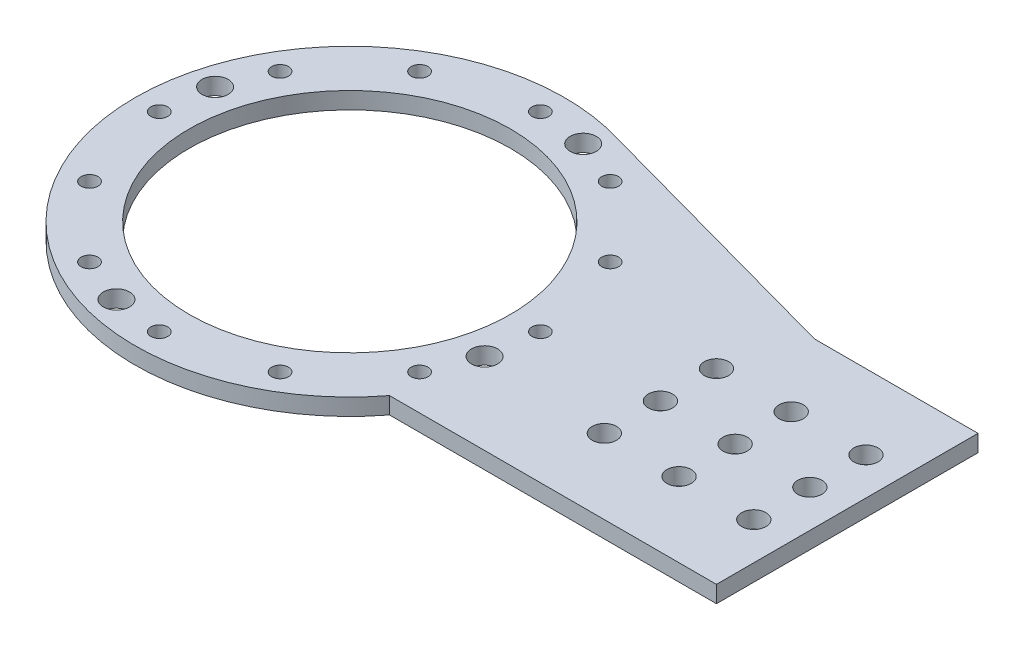
ISO-10303-21;
HEADER;
FILE_DESCRIPTION(('STEP AP214'),'2;1');
FILE_NAME('part.step','',(''),(''),'','','');
FILE_SCHEMA(('AUTOMOTIVE_DESIGN { 1 0 10303 214 1 1 1 1 }'));
ENDSEC;
DATA;
#1=APPLICATION_CONTEXT('core data for automotive mechanical design processes');
#2=APPLICATION_PROTOCOL_DEFINITION('international standard','automotive_design',2000,#1);
#3=PRODUCT_CONTEXT('',#1,'mechanical');
#4=PRODUCT('Part','Part','',(#3));
#5=PRODUCT_RELATED_PRODUCT_CATEGORY('part','',(#4));
#6=PRODUCT_DEFINITION_FORMATION('','',#4);
#7=PRODUCT_DEFINITION_CONTEXT('part definition',#1,'design');
#8=PRODUCT_DEFINITION('design','',#6,#7);
#9=PRODUCT_DEFINITION_SHAPE('','',#8);
#10=(LENGTH_UNIT() NAMED_UNIT(*) SI_UNIT(.MILLI.,.METRE.));
#11=(NAMED_UNIT(*) PLANE_ANGLE_UNIT() SI_UNIT($,.RADIAN.));
#12=(NAMED_UNIT(*) SI_UNIT($,.STERADIAN.) SOLID_ANGLE_UNIT());
#13=UNCERTAINTY_MEASURE_WITH_UNIT(LENGTH_MEASURE(1.E-05),#10,'distance_accuracy_value','');
#14=(GEOMETRIC_REPRESENTATION_CONTEXT(3) GLOBAL_UNCERTAINTY_ASSIGNED_CONTEXT((#13)) GLOBAL_UNIT_ASSIGNED_CONTEXT((#10,
#11,#12)) REPRESENTATION_CONTEXT('',''));
#15=CARTESIAN_POINT('',(0.,0.,0.));
#16=DIRECTION('',(0.,0.,1.));
#17=DIRECTION('',(1.,0.,0.));
#18=AXIS2_PLACEMENT_3D('',#15,#16,#17);
#19=CARTESIAN_POINT('',(83.1257980985413,-5.5,0.));
#20=DIRECTION('',(0.,1.,0.));
#21=DIRECTION('',(0.,0.,1.));
#22=AXIS2_PLACEMENT_3D('',#19,#20,#21);
#23=CYLINDRICAL_SURFACE('',#22,3.25000000000002);
#24=CARTESIAN_POINT('',(83.1257980985413,4.5,0.));
#25=DIRECTION('',(0.,1.,0.));
#26=DIRECTION('',(0.,0.,1.));
#27=AXIS2_PLACEMENT_3D('',#24,#25,#26);
#28=CIRCLE('',#27,3.25000000000002);
#29=CARTESIAN_POINT('',(83.1257980985413,4.5,3.25000000000002));
#30=VERTEX_POINT('',#29);
#31=EDGE_CURVE('E40',#30,#30,#28,.T.);
#32=ORIENTED_EDGE('',*,*,#31,.T.);
#33=EDGE_LOOP('',(#32));
#34=FACE_BOUND('',#33,.T.);
#35=CARTESIAN_POINT('',(83.1257980985413,0.,0.));
#36=DIRECTION('',(0.,1.,0.));
#37=DIRECTION('',(0.,0.,1.));
#38=AXIS2_PLACEMENT_3D('',#35,#36,#37);
#39=CIRCLE('',#38,3.25000000000002);
#40=CARTESIAN_POINT('',(83.1257980985413,0.,3.25000000000002));
#41=VERTEX_POINT('',#40);
#42=EDGE_CURVE('E11',#41,#41,#39,.T.);
#43=ORIENTED_EDGE('',*,*,#42,.F.);
#44=EDGE_LOOP('',(#43));
#45=FACE_BOUND('',#44,.T.);
#46=ADVANCED_FACE('F33',(#34,#45),#23,.F.);
#47=CARTESIAN_POINT('',(83.1257980985413,0.,15.));
#48=DIRECTION('',(0.,1.,0.));
#49=DIRECTION('',(0.,0.,1.));
#50=AXIS2_PLACEMENT_3D('',#47,#48,#49);
#51=CYLINDRICAL_SURFACE('',#50,3.25000000000001);
#52=CARTESIAN_POINT('',(83.1257980985413,0.,15.));
#53=DIRECTION('',(0.,1.,0.));
#54=DIRECTION('',(0.,0.,1.));
#55=AXIS2_PLACEMENT_3D('',#52,#53,#54);
#56=CIRCLE('',#55,3.25000000000001);
#57=CARTESIAN_POINT('',(83.1257980985413,0.,18.25));
#58=VERTEX_POINT('',#57);
#59=EDGE_CURVE('E120',#58,#58,#56,.T.);
#60=ORIENTED_EDGE('',*,*,#59,.F.);
#61=EDGE_LOOP('',(#60));
#62=FACE_BOUND('',#61,.T.);
#63=CARTESIAN_POINT('',(83.1257980985413,4.5,15.));
#64=DIRECTION('',(0.,1.,0.));
#65=DIRECTION('',(0.,0.,1.));
#66=AXIS2_PLACEMENT_3D('',#63,#64,#65);
#67=CIRCLE('',#66,3.25000000000001);
#68=CARTESIAN_POINT('',(83.1257980985413,4.5,18.25));
#69=VERTEX_POINT('',#68);
#70=EDGE_CURVE('E123',#69,#69,#67,.T.);
#71=ORIENTED_EDGE('',*,*,#70,.T.);
#72=EDGE_LOOP('',(#71));
#73=FACE_BOUND('',#72,.T.);
#74=ADVANCED_FACE('F191',(#62,#73),#51,.F.);
#75=CARTESIAN_POINT('',(83.1257980985413,0.,-15.));
#76=DIRECTION('',(0.,1.,0.));
#77=DIRECTION('',(0.,0.,1.));
#78=AXIS2_PLACEMENT_3D('',#75,#76,#77);
#79=CYLINDRICAL_SURFACE('',#78,3.25000000000001);
#80=CARTESIAN_POINT('',(83.1257980985413,0.,-15.));
#81=DIRECTION('',(0.,1.,0.));
#82=DIRECTION('',(0.,0.,1.));
#83=AXIS2_PLACEMENT_3D('',#80,#81,#82);
#84=CIRCLE('',#83,3.25000000000001);
#85=CARTESIAN_POINT('',(83.1257980985413,0.,-11.75));
#86=VERTEX_POINT('',#85);
#87=EDGE_CURVE('E113',#86,#86,#84,.T.);
#88=ORIENTED_EDGE('',*,*,#87,.F.);
#89=EDGE_LOOP('',(#88));
#90=FACE_BOUND('',#89,.T.);
#91=CARTESIAN_POINT('',(83.1257980985413,4.5,-15.));
#92=DIRECTION('',(0.,1.,0.));
#93=DIRECTION('',(0.,0.,1.));
#94=AXIS2_PLACEMENT_3D('',#91,#92,#93);
#95=CIRCLE('',#94,3.25000000000001);
#96=CARTESIAN_POINT('',(83.1257980985413,4.5,-11.75));
#97=VERTEX_POINT('',#96);
#98=EDGE_CURVE('E117',#97,#97,#95,.T.);
#99=ORIENTED_EDGE('',*,*,#98,.T.);
#100=EDGE_LOOP('',(#99));
#101=FACE_BOUND('',#100,.T.);
#102=ADVANCED_FACE('F195',(#90,#101),#79,.F.);
#103=CARTESIAN_POINT('',(0.,4.5,0.));
#104=DIRECTION('',(0.,-1.,0.));
#105=DIRECTION('',(0.,0.,-1.));
#106=AXIS2_PLACEMENT_3D('',#103,#104,#105);
#107=CYLINDRICAL_SURFACE('',#106,57.5);
#108=DIRECTION('',(0.,-1.,0.));
#109=VECTOR('',#108,1.);
#110=CARTESIAN_POINT('',(45.6207189772367,4.5,35.));
#111=LINE('',#110,#109);
#112=CARTESIAN_POINT('',(45.6207189772367,4.5,35.));
#113=VERTEX_POINT('',#112);
#114=CARTESIAN_POINT('',(45.6207189772367,0.,35.));
#115=VERTEX_POINT('',#114);
#116=EDGE_CURVE('E103',#113,#115,#111,.T.);
#117=ORIENTED_EDGE('',*,*,#116,.F.);
#118=CARTESIAN_POINT('',(0.,4.5,0.));
#119=DIRECTION('',(0.,1.,0.));
#120=DIRECTION('',(0.,0.,1.));
#121=AXIS2_PLACEMENT_3D('',#118,#119,#120);
#122=CIRCLE('',#121,57.5);
#123=CARTESIAN_POINT('',(16.7622892234834,4.5,-55.002505942805));
#124=VERTEX_POINT('',#123);
#125=EDGE_CURVE('E47',#124,#113,#122,.T.);
#126=ORIENTED_EDGE('',*,*,#125,.F.);
#127=DIRECTION('',(0.,-1.,0.));
#128=VECTOR('',#127,1.);
#129=CARTESIAN_POINT('',(16.7622892234842,4.5,-55.0025059428047));
#130=LINE('',#129,#128);
#131=CARTESIAN_POINT('',(16.7622892234834,0.,-55.002505942805));
#132=VERTEX_POINT('',#131);
#133=EDGE_CURVE('E51',#132,#124,#130,.F.);
#134=ORIENTED_EDGE('',*,*,#133,.F.);
#135=CARTESIAN_POINT('',(0.,0.,0.));
#136=DIRECTION('',(0.,1.,0.));
#137=DIRECTION('',(0.,0.,1.));
#138=AXIS2_PLACEMENT_3D('',#135,#136,#137);
#139=CIRCLE('',#138,57.5);
#140=EDGE_CURVE('E107',#132,#115,#139,.T.);
#141=ORIENTED_EDGE('',*,*,#140,.T.);
#142=EDGE_LOOP('',(#117,#126,#134,#141));
#143=FACE_BOUND('',#142,.T.);
#144=ADVANCED_FACE('F185',(#143),#107,.T.);
#145=CARTESIAN_POINT('',(133.125798098541,4.5,-35.));
#146=DIRECTION('',(0.,0.,1.));
#147=DIRECTION('',(1.,0.,0.));
#148=AXIS2_PLACEMENT_3D('',#145,#146,#147);
#149=PLANE('',#148);
#150=DIRECTION('',(0.,-1.,0.));
#151=VECTOR('',#150,1.);
#152=CARTESIAN_POINT('',(89.373258537889,4.5,-35.));
#153=LINE('',#152,#151);
#154=CARTESIAN_POINT('',(89.373258537889,4.5,-35.));
#155=VERTEX_POINT('',#154);
#156=CARTESIAN_POINT('',(89.373258537889,0.,-35.));
#157=VERTEX_POINT('',#156);
#158=EDGE_CURVE('E84',#155,#157,#153,.T.);
#159=ORIENTED_EDGE('',*,*,#158,.F.);
#160=DIRECTION('',(-1.,0.,0.));
#161=VECTOR('',#160,1.);
#162=CARTESIAN_POINT('',(133.125798098541,4.5,-35.));
#163=LINE('',#162,#161);
#164=CARTESIAN_POINT('',(133.125798098541,4.5,-35.));
#165=VERTEX_POINT('',#164);
#166=EDGE_CURVE('E77',#165,#155,#163,.T.);
#167=ORIENTED_EDGE('',*,*,#166,.F.);
#168=DIRECTION('',(0.,-1.,0.));
#169=VECTOR('',#168,1.);
#170=CARTESIAN_POINT('',(133.125798098541,4.5,-35.));
#171=LINE('',#170,#169);
#172=CARTESIAN_POINT('',(133.125798098541,0.,-35.));
#173=VERTEX_POINT('',#172);
#174=EDGE_CURVE('E81',#165,#173,#171,.T.);
#175=ORIENTED_EDGE('',*,*,#174,.T.);
#176=DIRECTION('',(-1.,0.,0.));
#177=VECTOR('',#176,1.);
#178=CARTESIAN_POINT('',(133.125798098541,0.,-35.));
#179=LINE('',#178,#177);
#180=EDGE_CURVE('E213',#173,#157,#179,.T.);
#181=ORIENTED_EDGE('',*,*,#180,.T.);
#182=EDGE_LOOP('',(#159,#167,#175,#181));
#183=FACE_BOUND('',#182,.T.);
#184=ADVANCED_FACE('F79',(#183),#149,.F.);
#185=CARTESIAN_POINT('',(0.,4.5,0.));
#186=DIRECTION('',(0.,1.,0.));
#187=DIRECTION('',(0.,0.,1.));
#188=AXIS2_PLACEMENT_3D('',#185,#186,#187);
#189=PLANE('',#188);
#190=CARTESIAN_POINT('',(103.125798098541,4.5,0.));
#191=DIRECTION('',(0.,1.,0.));
#192=DIRECTION('',(0.,0.,1.));
#193=AXIS2_PLACEMENT_3D('',#190,#191,#192);
#194=CIRCLE('',#193,3.25000000000002);
#195=CARTESIAN_POINT('',(103.125798098541,4.5,3.25000000000002));
#196=VERTEX_POINT('',#195);
#197=EDGE_CURVE('E318',#196,#196,#194,.T.);
#198=ORIENTED_EDGE('',*,*,#197,.F.);
#199=EDGE_LOOP('',(#198));
#200=FACE_BOUND('',#199,.T.);
#201=CARTESIAN_POINT('',(123.125798098541,4.5,0.));
#202=DIRECTION('',(0.,1.,0.));
#203=DIRECTION('',(0.,0.,1.));
#204=AXIS2_PLACEMENT_3D('',#201,#202,#203);
#205=CIRCLE('',#204,3.25000000000002);
#206=CARTESIAN_POINT('',(123.125798098541,4.5,3.25000000000002));
#207=VERTEX_POINT('',#206);
#208=EDGE_CURVE('E168',#207,#207,#205,.T.);
#209=ORIENTED_EDGE('',*,*,#208,.F.);
#210=EDGE_LOOP('',(#209));
#211=FACE_BOUND('',#210,.T.);
#212=CARTESIAN_POINT('',(-13.1997713002284,4.5,49.2622171407425));
#213=DIRECTION('',(0.,1.,0.));
#214=DIRECTION('',(1.,0.,0.));
#215=AXIS2_PLACEMENT_3D('',#212,#213,#214);
#216=CIRCLE('',#215,3.5);
#217=CARTESIAN_POINT('',(-9.69977130022841,4.5,49.2622171407425));
#218=VERTEX_POINT('',#217);
#219=EDGE_CURVE('E308',#218,#218,#216,.T.);
#220=ORIENTED_EDGE('',*,*,#219,.F.);
#221=EDGE_LOOP('',(#220));
#222=FACE_BOUND('',#221,.T.);
#223=CARTESIAN_POINT('',(49.2622171407425,4.5,13.1997713002286));
#224=DIRECTION('',(0.,1.,0.));
#225=DIRECTION('',(0.,0.,-1.));
#226=AXIS2_PLACEMENT_3D('',#223,#224,#225);
#227=CIRCLE('',#226,3.5);
#228=CARTESIAN_POINT('',(49.2622171407425,4.5,9.69977130022858));
#229=VERTEX_POINT('',#228);
#230=EDGE_CURVE('E302',#229,#229,#227,.T.);
#231=ORIENTED_EDGE('',*,*,#230,.F.);
#232=EDGE_LOOP('',(#231));
#233=FACE_BOUND('',#232,.T.);
#234=CARTESIAN_POINT('',(13.1997713002281,4.5,-49.2622171407426));
#235=DIRECTION('',(0.,1.,0.));
#236=DIRECTION('',(-1.,0.,0.));
#237=AXIS2_PLACEMENT_3D('',#234,#235,#236);
#238=CIRCLE('',#237,3.5);
#239=CARTESIAN_POINT('',(9.69977130022807,4.5,-49.2622171407426));
#240=VERTEX_POINT('',#239);
#241=EDGE_CURVE('E167',#240,#240,#238,.T.);
#242=ORIENTED_EDGE('',*,*,#241,.F.);
#243=EDGE_LOOP('',(#242));
#244=FACE_BOUND('',#243,.T.);
#245=CARTESIAN_POINT('',(-49.2622171407425,4.5,-13.1997713002286));
#246=DIRECTION('',(0.,1.,0.));
#247=DIRECTION('',(0.,0.,1.));
#248=AXIS2_PLACEMENT_3D('',#245,#246,#247);
#249=CIRCLE('',#248,3.5);
#250=CARTESIAN_POINT('',(-49.2622171407425,4.5,-9.69977130022858));
#251=VERTEX_POINT('',#250);
#252=EDGE_CURVE('E291',#251,#251,#249,.T.);
#253=ORIENTED_EDGE('',*,*,#252,.F.);
#254=EDGE_LOOP('',(#253));
#255=FACE_BOUND('',#254,.T.);
#256=CARTESIAN_POINT('',(-25.4999999999999,4.5,44.1672955930064));
#257=DIRECTION('',(0.,1.,0.));
#258=DIRECTION('',(0.86602540378444,0.,0.499999999999998));
#259=AXIS2_PLACEMENT_3D('',#256,#257,#258);
#260=CIRCLE('',#259,2.25);
#261=CARTESIAN_POINT('',(-23.5514428414849,4.5,45.2922955930064));
#262=VERTEX_POINT('',#261);
#263=EDGE_CURVE('E260',#262,#262,#260,.T.);
#264=ORIENTED_EDGE('',*,*,#263,.F.);
#265=EDGE_LOOP('',(#264));
#266=FACE_BOUND('',#265,.T.);
#267=CARTESIAN_POINT('',(1.78065548281E-13,4.5,51.));
#268=DIRECTION('',(0.,1.,0.));
#269=DIRECTION('',(1.,0.,0.));
#270=AXIS2_PLACEMENT_3D('',#267,#268,#269);
#271=CIRCLE('',#270,2.25);
#272=CARTESIAN_POINT('',(2.25000000000017,4.5,51.));
#273=VERTEX_POINT('',#272);
#274=EDGE_CURVE('E280',#273,#273,#271,.T.);
#275=ORIENTED_EDGE('',*,*,#274,.F.);
#276=EDGE_LOOP('',(#275));
#277=FACE_BOUND('',#276,.T.);
#278=CARTESIAN_POINT('',(25.5000000000002,4.5,44.1672955930063));
#279=DIRECTION('',(0.,1.,0.));
#280=DIRECTION('',(0.866025403784436,0.,-0.500000000000004));
#281=AXIS2_PLACEMENT_3D('',#278,#279,#280);
#282=CIRCLE('',#281,2.25);
#283=CARTESIAN_POINT('',(27.4485571585152,4.5,43.0422955930063));
#284=VERTEX_POINT('',#283);
#285=EDGE_CURVE('E277',#284,#284,#282,.T.);
#286=ORIENTED_EDGE('',*,*,#285,.F.);
#287=EDGE_LOOP('',(#286));
#288=FACE_BOUND('',#287,.T.);
#289=CARTESIAN_POINT('',(44.1672955930065,4.5,25.4999999999997));
#290=DIRECTION('',(0.,1.,0.));
#291=DIRECTION('',(0.499999999999995,0.,-0.866025403784442));
#292=AXIS2_PLACEMENT_3D('',#289,#290,#291);
#293=CIRCLE('',#292,2.25);
#294=CARTESIAN_POINT('',(45.2922955930065,4.5,23.5514428414848));
#295=VERTEX_POINT('',#294);
#296=EDGE_CURVE('E274',#295,#295,#293,.T.);
#297=ORIENTED_EDGE('',*,*,#296,.F.);
#298=EDGE_LOOP('',(#297));
#299=FACE_BOUND('',#298,.T.);
#300=CARTESIAN_POINT('',(51.,4.5,0.));
#301=DIRECTION('',(0.,1.,0.));
#302=DIRECTION('',(0.,0.,-1.));
#303=AXIS2_PLACEMENT_3D('',#300,#301,#302);
#304=CIRCLE('',#303,2.25);
#305=CARTESIAN_POINT('',(51.,4.5,-2.25));
#306=VERTEX_POINT('',#305);
#307=EDGE_CURVE('E271',#306,#306,#304,.T.);
#308=ORIENTED_EDGE('',*,*,#307,.F.);
#309=EDGE_LOOP('',(#308));
#310=FACE_BOUND('',#309,.T.);
#311=CARTESIAN_POINT('',(44.1672955930062,4.5,-25.5000000000004));
#312=DIRECTION('',(0.,1.,0.));
#313=DIRECTION('',(-0.500000000000007,0.,-0.866025403784435));
#314=AXIS2_PLACEMENT_3D('',#311,#312,#313);
#315=CIRCLE('',#314,2.25);
#316=CARTESIAN_POINT('',(43.0422955930061,4.5,-27.4485571585153));
#317=VERTEX_POINT('',#316);
#318=EDGE_CURVE('E268',#317,#317,#315,.T.);
#319=ORIENTED_EDGE('',*,*,#318,.F.);
#320=EDGE_LOOP('',(#319));
#321=FACE_BOUND('',#320,.T.);
#322=CARTESIAN_POINT('',(25.4999999999996,4.5,-44.1672955930066));
#323=DIRECTION('',(0.,1.,0.));
#324=DIRECTION('',(-0.866025403784443,0.,-0.499999999999992));
#325=AXIS2_PLACEMENT_3D('',#322,#323,#324);
#326=CIRCLE('',#325,2.25);
#327=CARTESIAN_POINT('',(23.5514428414846,4.5,-45.2922955930066));
#328=VERTEX_POINT('',#327);
#329=EDGE_CURVE('E264',#328,#328,#326,.T.);
#330=ORIENTED_EDGE('',*,*,#329,.F.);
#331=EDGE_LOOP('',(#330));
#332=FACE_BOUND('',#331,.T.);
#333=CARTESIAN_POINT('',(-5.34196644842999E-13,4.5,-51.));
#334=DIRECTION('',(0.,1.,0.));
#335=DIRECTION('',(-1.,0.,0.));
#336=AXIS2_PLACEMENT_3D('',#333,#334,#335);
#337=CIRCLE('',#336,2.25);
#338=CARTESIAN_POINT('',(-2.25000000000053,4.5,-51.));
#339=VERTEX_POINT('',#338);
#340=EDGE_CURVE('E261',#339,#339,#337,.T.);
#341=ORIENTED_EDGE('',*,*,#340,.F.);
#342=EDGE_LOOP('',(#341));
#343=FACE_BOUND('',#342,.T.);
#344=CARTESIAN_POINT('',(-25.5000000000005,4.5,-44.1672955930061));
#345=DIRECTION('',(0.,1.,0.));
#346=DIRECTION('',(-0.866025403784433,0.,0.50000000000001));
#347=AXIS2_PLACEMENT_3D('',#344,#345,#346);
#348=CIRCLE('',#347,2.25);
#349=CARTESIAN_POINT('',(-27.4485571585155,4.5,-43.042295593006));
#350=VERTEX_POINT('',#349);
#351=EDGE_CURVE('E265',#350,#350,#348,.T.);
#352=ORIENTED_EDGE('',*,*,#351,.F.);
#353=EDGE_LOOP('',(#352));
#354=FACE_BOUND('',#353,.T.);
#355=CARTESIAN_POINT('',(-44.1672955930067,4.5,-25.4999999999994));
#356=DIRECTION('',(0.,1.,0.));
#357=DIRECTION('',(-0.499999999999989,0.,0.866025403784445));
#358=AXIS2_PLACEMENT_3D('',#355,#356,#357);
#359=CIRCLE('',#358,2.25);
#360=CARTESIAN_POINT('',(-45.2922955930067,4.5,-23.5514428414844));
#361=VERTEX_POINT('',#360);
#362=EDGE_CURVE('E285',#361,#361,#359,.T.);
#363=ORIENTED_EDGE('',*,*,#362,.F.);
#364=EDGE_LOOP('',(#363));
#365=FACE_BOUND('',#364,.T.);
#366=CARTESIAN_POINT('',(-44.1672955930063,4.5,25.5));
#367=DIRECTION('',(0.,1.,0.));
#368=DIRECTION('',(0.500000000000001,0.,0.866025403784438));
#369=AXIS2_PLACEMENT_3D('',#366,#367,#368);
#370=CIRCLE('',#369,2.25);
#371=CARTESIAN_POINT('',(-43.0422955930063,4.5,27.448557158515));
#372=VERTEX_POINT('',#371);
#373=EDGE_CURVE('E135',#372,#372,#370,.T.);
#374=ORIENTED_EDGE('',*,*,#373,.F.);
#375=EDGE_LOOP('',(#374));
#376=FACE_BOUND('',#375,.T.);
#377=CARTESIAN_POINT('',(-51.,4.5,0.));
#378=DIRECTION('',(0.,1.,0.));
#379=DIRECTION('',(0.,0.,1.));
#380=AXIS2_PLACEMENT_3D('',#377,#378,#379);
#381=CIRCLE('',#380,2.25);
#382=CARTESIAN_POINT('',(-51.,4.5,2.25));
#383=VERTEX_POINT('',#382);
#384=EDGE_CURVE('E130',#383,#383,#381,.T.);
#385=ORIENTED_EDGE('',*,*,#384,.F.);
#386=EDGE_LOOP('',(#385));
#387=FACE_BOUND('',#386,.T.);
#388=CARTESIAN_POINT('',(103.125798098541,4.5,15.));
#389=DIRECTION('',(0.,1.,0.));
#390=DIRECTION('',(0.,0.,1.));
#391=AXIS2_PLACEMENT_3D('',#388,#389,#390);
#392=CIRCLE('',#391,3.25000000000001);
#393=CARTESIAN_POINT('',(103.125798098541,4.5,18.25));
#394=VERTEX_POINT('',#393);
#395=EDGE_CURVE('E251',#394,#394,#392,.T.);
#396=ORIENTED_EDGE('',*,*,#395,.F.);
#397=EDGE_LOOP('',(#396));
#398=FACE_BOUND('',#397,.T.);
#399=CARTESIAN_POINT('',(103.125798098541,4.5,-15.));
#400=DIRECTION('',(0.,1.,0.));
#401=DIRECTION('',(0.,0.,1.));
#402=AXIS2_PLACEMENT_3D('',#399,#400,#401);
#403=CIRCLE('',#402,3.25000000000001);
#404=CARTESIAN_POINT('',(103.125798098541,4.5,-11.75));
#405=VERTEX_POINT('',#404);
#406=EDGE_CURVE('E238',#405,#405,#403,.T.);
#407=ORIENTED_EDGE('',*,*,#406,.F.);
#408=EDGE_LOOP('',(#407));
#409=FACE_BOUND('',#408,.T.);
#410=CARTESIAN_POINT('',(123.125798098541,4.5,-15.));
#411=DIRECTION('',(0.,1.,0.));
#412=DIRECTION('',(0.,0.,1.));
#413=AXIS2_PLACEMENT_3D('',#410,#411,#412);
#414=CIRCLE('',#413,3.25000000000001);
#415=CARTESIAN_POINT('',(123.125798098541,4.5,-11.75));
#416=VERTEX_POINT('',#415);
#417=EDGE_CURVE('E241',#416,#416,#414,.T.);
#418=ORIENTED_EDGE('',*,*,#417,.F.);
#419=EDGE_LOOP('',(#418));
#420=FACE_BOUND('',#419,.T.);
#421=CARTESIAN_POINT('',(123.125798098541,4.5,15.));
#422=DIRECTION('',(0.,1.,0.));
#423=DIRECTION('',(0.,0.,1.));
#424=AXIS2_PLACEMENT_3D('',#421,#422,#423);
#425=CIRCLE('',#424,3.25000000000001);
#426=CARTESIAN_POINT('',(123.125798098541,4.5,18.25));
#427=VERTEX_POINT('',#426);
#428=EDGE_CURVE('E234',#427,#427,#425,.T.);
#429=ORIENTED_EDGE('',*,*,#428,.F.);
#430=EDGE_LOOP('',(#429));
#431=FACE_BOUND('',#430,.T.);
#432=CARTESIAN_POINT('',(0.,4.5,0.));
#433=DIRECTION('',(0.,1.,0.));
#434=DIRECTION('',(0.,0.,1.));
#435=AXIS2_PLACEMENT_3D('',#432,#433,#434);
#436=CIRCLE('',#435,43.);
#437=CARTESIAN_POINT('',(0.,4.5,43.));
#438=VERTEX_POINT('',#437);
#439=EDGE_CURVE('E228',#438,#438,#436,.T.);
#440=ORIENTED_EDGE('',*,*,#439,.F.);
#441=EDGE_LOOP('',(#440));
#442=FACE_BOUND('',#441,.T.);
#443=DIRECTION('',(-0.964088221769249,0.,-0.265582191883806));
#444=VECTOR('',#443,1.);
#445=CARTESIAN_POINT('',(89.373258537889,4.5,-35.));
#446=LINE('',#445,#444);
#447=EDGE_CURVE('E220',#155,#124,#446,.T.);
#448=ORIENTED_EDGE('',*,*,#447,.T.);
#449=ORIENTED_EDGE('',*,*,#125,.T.);
#450=DIRECTION('',(1.,0.,0.));
#451=VECTOR('',#450,1.);
#452=CARTESIAN_POINT('',(133.125798098541,4.5,35.));
#453=LINE('',#452,#451);
#454=CARTESIAN_POINT('',(133.125798098541,4.5,35.));
#455=VERTEX_POINT('',#454);
#456=EDGE_CURVE('E88',#113,#455,#453,.T.);
#457=ORIENTED_EDGE('',*,*,#456,.T.);
#458=DIRECTION('',(0.,0.,-1.));
#459=VECTOR('',#458,1.);
#460=CARTESIAN_POINT('',(133.125798098541,4.5,-35.));
#461=LINE('',#460,#459);
#462=EDGE_CURVE('E89',#455,#165,#461,.T.);
#463=ORIENTED_EDGE('',*,*,#462,.T.);
#464=ORIENTED_EDGE('',*,*,#166,.T.);
#465=EDGE_LOOP('',(#448,#449,#457,#463,#464));
#466=FACE_BOUND('',#465,.T.);
#467=ORIENTED_EDGE('',*,*,#98,.F.);
#468=EDGE_LOOP('',(#467));
#469=FACE_BOUND('',#468,.T.);
#470=ORIENTED_EDGE('',*,*,#70,.F.);
#471=EDGE_LOOP('',(#470));
#472=FACE_BOUND('',#471,.T.);
#473=ORIENTED_EDGE('',*,*,#31,.F.);
#474=EDGE_LOOP('',(#473));
#475=FACE_BOUND('',#474,.T.);
#476=ADVANCED_FACE('F92',(#200,#211,#222,#233,#244,#255,#266,#277,#288,#299,#310,#321,#332,#343,
#354,#365,#376,#387,#398,#409,#420,#431,#442,#466,#469,#472,#475),#189,.T.);
#477=CARTESIAN_POINT('',(0.,0.,0.));
#478=DIRECTION('',(0.,1.,0.));
#479=DIRECTION('',(0.,0.,1.));
#480=AXIS2_PLACEMENT_3D('',#477,#478,#479);
#481=PLANE('',#480);
#482=CARTESIAN_POINT('',(103.125798098541,0.,0.));
#483=DIRECTION('',(0.,1.,0.));
#484=DIRECTION('',(0.,0.,1.));
#485=AXIS2_PLACEMENT_3D('',#482,#483,#484);
#486=CIRCLE('',#485,3.25000000000002);
#487=CARTESIAN_POINT('',(103.125798098541,0.,3.25000000000002));
#488=VERTEX_POINT('',#487);
#489=EDGE_CURVE('E315',#488,#488,#486,.T.);
#490=ORIENTED_EDGE('',*,*,#489,.T.);
#491=EDGE_LOOP('',(#490));
#492=FACE_BOUND('',#491,.T.);
#493=CARTESIAN_POINT('',(123.125798098541,0.,0.));
#494=DIRECTION('',(0.,1.,0.));
#495=DIRECTION('',(0.,0.,1.));
#496=AXIS2_PLACEMENT_3D('',#493,#494,#495);
#497=CIRCLE('',#496,3.25000000000002);
#498=CARTESIAN_POINT('',(123.125798098541,0.,3.25000000000002));
#499=VERTEX_POINT('',#498);
#500=EDGE_CURVE('E165',#499,#499,#497,.T.);
#501=ORIENTED_EDGE('',*,*,#500,.T.);
#502=EDGE_LOOP('',(#501));
#503=FACE_BOUND('',#502,.T.);
#504=CARTESIAN_POINT('',(-13.1997713002284,0.,49.2622171407425));
#505=DIRECTION('',(0.,1.,0.));
#506=DIRECTION('',(1.,0.,0.));
#507=AXIS2_PLACEMENT_3D('',#504,#505,#506);
#508=CIRCLE('',#507,3.5);
#509=CARTESIAN_POINT('',(-9.69977130022841,0.,49.2622171407425));
#510=VERTEX_POINT('',#509);
#511=EDGE_CURVE('E294',#510,#510,#508,.T.);
#512=ORIENTED_EDGE('',*,*,#511,.T.);
#513=EDGE_LOOP('',(#512));
#514=FACE_BOUND('',#513,.T.);
#515=CARTESIAN_POINT('',(49.2622171407425,0.,13.1997713002286));
#516=DIRECTION('',(0.,1.,0.));
#517=DIRECTION('',(0.,0.,-1.));
#518=AXIS2_PLACEMENT_3D('',#515,#516,#517);
#519=CIRCLE('',#518,3.5);
#520=CARTESIAN_POINT('',(49.2622171407425,0.,9.69977130022858));
#521=VERTEX_POINT('',#520);
#522=EDGE_CURVE('E305',#521,#521,#519,.T.);
#523=ORIENTED_EDGE('',*,*,#522,.T.);
#524=EDGE_LOOP('',(#523));
#525=FACE_BOUND('',#524,.T.);
#526=CARTESIAN_POINT('',(13.1997713002281,0.,-49.2622171407426));
#527=DIRECTION('',(0.,1.,0.));
#528=DIRECTION('',(-1.,0.,0.));
#529=AXIS2_PLACEMENT_3D('',#526,#527,#528);
#530=CIRCLE('',#529,3.5);
#531=CARTESIAN_POINT('',(9.69977130022807,0.,-49.2622171407426));
#532=VERTEX_POINT('',#531);
#533=EDGE_CURVE('E299',#532,#532,#530,.T.);
#534=ORIENTED_EDGE('',*,*,#533,.T.);
#535=EDGE_LOOP('',(#534));
#536=FACE_BOUND('',#535,.T.);
#537=CARTESIAN_POINT('',(-49.2622171407425,0.,-13.1997713002286));
#538=DIRECTION('',(0.,1.,0.));
#539=DIRECTION('',(0.,0.,1.));
#540=AXIS2_PLACEMENT_3D('',#537,#538,#539);
#541=CIRCLE('',#540,3.5);
#542=CARTESIAN_POINT('',(-49.2622171407425,0.,-9.69977130022858));
#543=VERTEX_POINT('',#542);
#544=EDGE_CURVE('E288',#543,#543,#541,.T.);
#545=ORIENTED_EDGE('',*,*,#544,.T.);
#546=EDGE_LOOP('',(#545));
#547=FACE_BOUND('',#546,.T.);
#548=CARTESIAN_POINT('',(-25.4999999999999,0.,44.1672955930064));
#549=DIRECTION('',(0.,1.,0.));
#550=DIRECTION('',(0.,0.,1.));
#551=AXIS2_PLACEMENT_3D('',#548,#549,#550);
#552=CIRCLE('',#551,2.25);
#553=CARTESIAN_POINT('',(-25.4999999999999,0.,46.4172955930064));
#554=VERTEX_POINT('',#553);
#555=EDGE_CURVE('E162',#554,#554,#552,.T.);
#556=ORIENTED_EDGE('',*,*,#555,.T.);
#557=EDGE_LOOP('',(#556));
#558=FACE_BOUND('',#557,.T.);
#559=CARTESIAN_POINT('',(1.78065548281E-13,0.,51.));
#560=DIRECTION('',(0.,1.,0.));
#561=DIRECTION('',(0.,0.,1.));
#562=AXIS2_PLACEMENT_3D('',#559,#560,#561);
#563=CIRCLE('',#562,2.25);
#564=CARTESIAN_POINT('',(1.78065548281E-13,0.,53.25));
#565=VERTEX_POINT('',#564);
#566=EDGE_CURVE('E159',#565,#565,#563,.T.);
#567=ORIENTED_EDGE('',*,*,#566,.T.);
#568=EDGE_LOOP('',(#567));
#569=FACE_BOUND('',#568,.T.);
#570=CARTESIAN_POINT('',(25.5000000000002,0.,44.1672955930063));
#571=DIRECTION('',(0.,1.,0.));
#572=DIRECTION('',(0.,0.,1.));
#573=AXIS2_PLACEMENT_3D('',#570,#571,#572);
#574=CIRCLE('',#573,2.25);
#575=CARTESIAN_POINT('',(25.5000000000002,0.,46.4172955930063));
#576=VERTEX_POINT('',#575);
#577=EDGE_CURVE('E156',#576,#576,#574,.T.);
#578=ORIENTED_EDGE('',*,*,#577,.T.);
#579=EDGE_LOOP('',(#578));
#580=FACE_BOUND('',#579,.T.);
#581=CARTESIAN_POINT('',(44.1672955930065,0.,25.4999999999997));
#582=DIRECTION('',(0.,1.,0.));
#583=DIRECTION('',(0.,0.,1.));
#584=AXIS2_PLACEMENT_3D('',#581,#582,#583);
#585=CIRCLE('',#584,2.25);
#586=CARTESIAN_POINT('',(44.1672955930065,0.,27.7499999999997));
#587=VERTEX_POINT('',#586);
#588=EDGE_CURVE('E153',#587,#587,#585,.T.);
#589=ORIENTED_EDGE('',*,*,#588,.T.);
#590=EDGE_LOOP('',(#589));
#591=FACE_BOUND('',#590,.T.);
#592=CARTESIAN_POINT('',(51.,0.,0.));
#593=DIRECTION('',(0.,1.,0.));
#594=DIRECTION('',(0.,0.,1.));
#595=AXIS2_PLACEMENT_3D('',#592,#593,#594);
#596=CIRCLE('',#595,2.25);
#597=CARTESIAN_POINT('',(51.,0.,2.25));
#598=VERTEX_POINT('',#597);
#599=EDGE_CURVE('E150',#598,#598,#596,.T.);
#600=ORIENTED_EDGE('',*,*,#599,.T.);
#601=EDGE_LOOP('',(#600));
#602=FACE_BOUND('',#601,.T.);
#603=CARTESIAN_POINT('',(44.1672955930062,0.,-25.5000000000004));
#604=DIRECTION('',(0.,1.,0.));
#605=DIRECTION('',(0.,0.,1.));
#606=AXIS2_PLACEMENT_3D('',#603,#604,#605);
#607=CIRCLE('',#606,2.25);
#608=CARTESIAN_POINT('',(44.1672955930062,0.,-23.2500000000004));
#609=VERTEX_POINT('',#608);
#610=EDGE_CURVE('E147',#609,#609,#607,.T.);
#611=ORIENTED_EDGE('',*,*,#610,.T.);
#612=EDGE_LOOP('',(#611));
#613=FACE_BOUND('',#612,.T.);
#614=CARTESIAN_POINT('',(25.4999999999996,0.,-44.1672955930066));
#615=DIRECTION('',(0.,1.,0.));
#616=DIRECTION('',(0.,0.,1.));
#617=AXIS2_PLACEMENT_3D('',#614,#615,#616);
#618=CIRCLE('',#617,2.25);
#619=CARTESIAN_POINT('',(25.4999999999996,0.,-41.9172955930066));
#620=VERTEX_POINT('',#619);
#621=EDGE_CURVE('E144',#620,#620,#618,.T.);
#622=ORIENTED_EDGE('',*,*,#621,.T.);
#623=EDGE_LOOP('',(#622));
#624=FACE_BOUND('',#623,.T.);
#625=CARTESIAN_POINT('',(-5.34196644842999E-13,0.,-51.));
#626=DIRECTION('',(0.,1.,0.));
#627=DIRECTION('',(0.,0.,1.));
#628=AXIS2_PLACEMENT_3D('',#625,#626,#627);
#629=CIRCLE('',#628,2.25);
#630=CARTESIAN_POINT('',(-5.34196644842999E-13,0.,-48.75));
#631=VERTEX_POINT('',#630);
#632=EDGE_CURVE('E141',#631,#631,#629,.T.);
#633=ORIENTED_EDGE('',*,*,#632,.T.);
#634=EDGE_LOOP('',(#633));
#635=FACE_BOUND('',#634,.T.);
#636=CARTESIAN_POINT('',(-25.5000000000005,0.,-44.1672955930061));
#637=DIRECTION('',(0.,1.,0.));
#638=DIRECTION('',(0.,0.,1.));
#639=AXIS2_PLACEMENT_3D('',#636,#637,#638);
#640=CIRCLE('',#639,2.25);
#641=CARTESIAN_POINT('',(-25.5000000000005,0.,-41.9172955930061));
#642=VERTEX_POINT('',#641);
#643=EDGE_CURVE('E138',#642,#642,#640,.T.);
#644=ORIENTED_EDGE('',*,*,#643,.T.);
#645=EDGE_LOOP('',(#644));
#646=FACE_BOUND('',#645,.T.);
#647=CARTESIAN_POINT('',(-44.1672955930067,0.,-25.4999999999994));
#648=DIRECTION('',(0.,1.,0.));
#649=DIRECTION('',(0.,0.,1.));
#650=AXIS2_PLACEMENT_3D('',#647,#648,#649);
#651=CIRCLE('',#650,2.25);
#652=CARTESIAN_POINT('',(-44.1672955930067,0.,-23.2499999999994));
#653=VERTEX_POINT('',#652);
#654=EDGE_CURVE('E134',#653,#653,#651,.T.);
#655=ORIENTED_EDGE('',*,*,#654,.T.);
#656=EDGE_LOOP('',(#655));
#657=FACE_BOUND('',#656,.T.);
#658=CARTESIAN_POINT('',(-44.1672955930063,0.,25.5));
#659=DIRECTION('',(0.,1.,0.));
#660=DIRECTION('',(0.,0.,1.));
#661=AXIS2_PLACEMENT_3D('',#658,#659,#660);
#662=CIRCLE('',#661,2.25);
#663=CARTESIAN_POINT('',(-44.1672955930063,0.,27.75));
#664=VERTEX_POINT('',#663);
#665=EDGE_CURVE('E131',#664,#664,#662,.T.);
#666=ORIENTED_EDGE('',*,*,#665,.T.);
#667=EDGE_LOOP('',(#666));
#668=FACE_BOUND('',#667,.T.);
#669=CARTESIAN_POINT('',(-51.,0.,0.));
#670=DIRECTION('',(0.,1.,0.));
#671=DIRECTION('',(0.,0.,1.));
#672=AXIS2_PLACEMENT_3D('',#669,#670,#671);
#673=CIRCLE('',#672,2.25);
#674=CARTESIAN_POINT('',(-51.,0.,2.25));
#675=VERTEX_POINT('',#674);
#676=EDGE_CURVE('E126',#675,#675,#673,.T.);
#677=ORIENTED_EDGE('',*,*,#676,.T.);
#678=EDGE_LOOP('',(#677));
#679=FACE_BOUND('',#678,.T.);
#680=CARTESIAN_POINT('',(103.125798098541,0.,15.));
#681=DIRECTION('',(0.,1.,0.));
#682=DIRECTION('',(0.,0.,1.));
#683=AXIS2_PLACEMENT_3D('',#680,#681,#682);
#684=CIRCLE('',#683,3.25000000000001);
#685=CARTESIAN_POINT('',(103.125798098541,0.,18.25));
#686=VERTEX_POINT('',#685);
#687=EDGE_CURVE('E129',#686,#686,#684,.T.);
#688=ORIENTED_EDGE('',*,*,#687,.T.);
#689=EDGE_LOOP('',(#688));
#690=FACE_BOUND('',#689,.T.);
#691=CARTESIAN_POINT('',(103.125798098541,0.,-15.));
#692=DIRECTION('',(0.,1.,0.));
#693=DIRECTION('',(0.,0.,1.));
#694=AXIS2_PLACEMENT_3D('',#691,#692,#693);
#695=CIRCLE('',#694,3.25000000000001);
#696=CARTESIAN_POINT('',(103.125798098541,0.,-11.75));
#697=VERTEX_POINT('',#696);
#698=EDGE_CURVE('E248',#697,#697,#695,.T.);
#699=ORIENTED_EDGE('',*,*,#698,.T.);
#700=EDGE_LOOP('',(#699));
#701=FACE_BOUND('',#700,.T.);
#702=CARTESIAN_POINT('',(123.125798098541,0.,-15.));
#703=DIRECTION('',(0.,1.,0.));
#704=DIRECTION('',(0.,0.,1.));
#705=AXIS2_PLACEMENT_3D('',#702,#703,#704);
#706=CIRCLE('',#705,3.25000000000001);
#707=CARTESIAN_POINT('',(123.125798098541,0.,-11.75));
#708=VERTEX_POINT('',#707);
#709=EDGE_CURVE('E231',#708,#708,#706,.T.);
#710=ORIENTED_EDGE('',*,*,#709,.T.);
#711=EDGE_LOOP('',(#710));
#712=FACE_BOUND('',#711,.T.);
#713=CARTESIAN_POINT('',(123.125798098541,0.,15.));
#714=DIRECTION('',(0.,1.,0.));
#715=DIRECTION('',(0.,0.,1.));
#716=AXIS2_PLACEMENT_3D('',#713,#714,#715);
#717=CIRCLE('',#716,3.25000000000001);
#718=CARTESIAN_POINT('',(123.125798098541,0.,18.25));
#719=VERTEX_POINT('',#718);
#720=EDGE_CURVE('E237',#719,#719,#717,.T.);
#721=ORIENTED_EDGE('',*,*,#720,.T.);
#722=EDGE_LOOP('',(#721));
#723=FACE_BOUND('',#722,.T.);
#724=CARTESIAN_POINT('',(0.,0.,0.));
#725=DIRECTION('',(0.,1.,0.));
#726=DIRECTION('',(0.,0.,1.));
#727=AXIS2_PLACEMENT_3D('',#724,#725,#726);
#728=CIRCLE('',#727,43.);
#729=CARTESIAN_POINT('',(0.,0.,43.));
#730=VERTEX_POINT('',#729);
#731=EDGE_CURVE('E221',#730,#730,#728,.T.);
#732=ORIENTED_EDGE('',*,*,#731,.T.);
#733=EDGE_LOOP('',(#732));
#734=FACE_BOUND('',#733,.T.);
#735=ORIENTED_EDGE('',*,*,#140,.F.);
#736=DIRECTION('',(-0.964088221769249,0.,-0.265582191883806));
#737=VECTOR('',#736,1.);
#738=CARTESIAN_POINT('',(89.373258537889,0.,-35.));
#739=LINE('',#738,#737);
#740=EDGE_CURVE('E218',#157,#132,#739,.T.);
#741=ORIENTED_EDGE('',*,*,#740,.F.);
#742=ORIENTED_EDGE('',*,*,#180,.F.);
#743=DIRECTION('',(0.,0.,-1.));
#744=VECTOR('',#743,1.);
#745=CARTESIAN_POINT('',(133.125798098541,0.,-35.));
#746=LINE('',#745,#744);
#747=CARTESIAN_POINT('',(133.125798098541,0.,35.));
#748=VERTEX_POINT('',#747);
#749=EDGE_CURVE('E102',#748,#173,#746,.T.);
#750=ORIENTED_EDGE('',*,*,#749,.F.);
#751=DIRECTION('',(1.,0.,0.));
#752=VECTOR('',#751,1.);
#753=CARTESIAN_POINT('',(133.125798098541,0.,35.));
#754=LINE('',#753,#752);
#755=EDGE_CURVE('E98',#115,#748,#754,.T.);
#756=ORIENTED_EDGE('',*,*,#755,.F.);
#757=EDGE_LOOP('',(#735,#741,#742,#750,#756));
#758=FACE_BOUND('',#757,.T.);
#759=ORIENTED_EDGE('',*,*,#87,.T.);
#760=EDGE_LOOP('',(#759));
#761=FACE_BOUND('',#760,.T.);
#762=ORIENTED_EDGE('',*,*,#59,.T.);
#763=EDGE_LOOP('',(#762));
#764=FACE_BOUND('',#763,.T.);
#765=ORIENTED_EDGE('',*,*,#42,.T.);
#766=EDGE_LOOP('',(#765));
#767=FACE_BOUND('',#766,.T.);
#768=ADVANCED_FACE('F175',(#492,#503,#514,#525,#536,#547,#558,#569,#580,#591,#602,#613,#624,
#635,#646,#657,#668,#679,#690,#701,#712,#723,#734,#758,#761,#764,#767),#481,.F.);
#769=CARTESIAN_POINT('',(133.125798098541,4.5,35.));
#770=DIRECTION('',(0.,0.,-1.));
#771=DIRECTION('',(-1.,0.,0.));
#772=AXIS2_PLACEMENT_3D('',#769,#770,#771);
#773=PLANE('',#772);
#774=ORIENTED_EDGE('',*,*,#456,.F.);
#775=ORIENTED_EDGE('',*,*,#116,.T.);
#776=ORIENTED_EDGE('',*,*,#755,.T.);
#777=DIRECTION('',(0.,-1.,0.));
#778=VECTOR('',#777,1.);
#779=CARTESIAN_POINT('',(133.125798098541,4.5,35.));
#780=LINE('',#779,#778);
#781=EDGE_CURVE('E104',#455,#748,#780,.T.);
#782=ORIENTED_EDGE('',*,*,#781,.F.);
#783=EDGE_LOOP('',(#774,#775,#776,#782));
#784=FACE_BOUND('',#783,.T.);
#785=ADVANCED_FACE('F182',(#784),#773,.F.);
#786=CARTESIAN_POINT('',(133.125798098541,4.5,-35.));
#787=DIRECTION('',(-1.,0.,0.));
#788=DIRECTION('',(0.,0.,1.));
#789=AXIS2_PLACEMENT_3D('',#786,#787,#788);
#790=PLANE('',#789);
#791=ORIENTED_EDGE('',*,*,#749,.T.);
#792=ORIENTED_EDGE('',*,*,#174,.F.);
#793=ORIENTED_EDGE('',*,*,#462,.F.);
#794=ORIENTED_EDGE('',*,*,#781,.T.);
#795=EDGE_LOOP('',(#791,#792,#793,#794));
#796=FACE_BOUND('',#795,.T.);
#797=ADVANCED_FACE('F100',(#796),#790,.F.);
#798=CARTESIAN_POINT('',(89.373258537889,4.5,-35.));
#799=DIRECTION('',(-0.265582191883806,0.,0.964088221769249));
#800=DIRECTION('',(0.964088221769249,0.,0.265582191883806));
#801=AXIS2_PLACEMENT_3D('',#798,#799,#800);
#802=PLANE('',#801);
#803=ORIENTED_EDGE('',*,*,#740,.T.);
#804=ORIENTED_EDGE('',*,*,#133,.T.);
#805=ORIENTED_EDGE('',*,*,#447,.F.);
#806=ORIENTED_EDGE('',*,*,#158,.T.);
#807=EDGE_LOOP('',(#803,#804,#805,#806));
#808=FACE_BOUND('',#807,.T.);
#809=ADVANCED_FACE('F223',(#808),#802,.F.);
#810=CARTESIAN_POINT('',(0.,0.,0.));
#811=DIRECTION('',(0.,1.,0.));
#812=DIRECTION('',(0.,0.,1.));
#813=AXIS2_PLACEMENT_3D('',#810,#811,#812);
#814=CYLINDRICAL_SURFACE('',#813,43.);
#815=ORIENTED_EDGE('',*,*,#731,.F.);
#816=EDGE_LOOP('',(#815));
#817=FACE_BOUND('',#816,.T.);
#818=ORIENTED_EDGE('',*,*,#439,.T.);
#819=EDGE_LOOP('',(#818));
#820=FACE_BOUND('',#819,.T.);
#821=ADVANCED_FACE('F372',(#817,#820),#814,.F.);
#822=CARTESIAN_POINT('',(123.125798098541,0.,15.));
#823=DIRECTION('',(0.,1.,0.));
#824=DIRECTION('',(0.,0.,1.));
#825=AXIS2_PLACEMENT_3D('',#822,#823,#824);
#826=CYLINDRICAL_SURFACE('',#825,3.25000000000001);
#827=ORIENTED_EDGE('',*,*,#720,.F.);
#828=EDGE_LOOP('',(#827));
#829=FACE_BOUND('',#828,.T.);
#830=ORIENTED_EDGE('',*,*,#428,.T.);
#831=EDGE_LOOP('',(#830));
#832=FACE_BOUND('',#831,.T.);
#833=ADVANCED_FACE('F375',(#829,#832),#826,.F.);
#834=CARTESIAN_POINT('',(123.125798098541,0.,-15.));
#835=DIRECTION('',(0.,1.,0.));
#836=DIRECTION('',(0.,0.,1.));
#837=AXIS2_PLACEMENT_3D('',#834,#835,#836);
#838=CYLINDRICAL_SURFACE('',#837,3.25000000000001);
#839=ORIENTED_EDGE('',*,*,#709,.F.);
#840=EDGE_LOOP('',(#839));
#841=FACE_BOUND('',#840,.T.);
#842=ORIENTED_EDGE('',*,*,#417,.T.);
#843=EDGE_LOOP('',(#842));
#844=FACE_BOUND('',#843,.T.);
#845=ADVANCED_FACE('F383',(#841,#844),#838,.F.);
#846=CARTESIAN_POINT('',(103.125798098541,0.,-15.));
#847=DIRECTION('',(0.,1.,0.));
#848=DIRECTION('',(0.,0.,1.));
#849=AXIS2_PLACEMENT_3D('',#846,#847,#848);
#850=CYLINDRICAL_SURFACE('',#849,3.25000000000001);
#851=ORIENTED_EDGE('',*,*,#698,.F.);
#852=EDGE_LOOP('',(#851));
#853=FACE_BOUND('',#852,.T.);
#854=ORIENTED_EDGE('',*,*,#406,.T.);
#855=EDGE_LOOP('',(#854));
#856=FACE_BOUND('',#855,.T.);
#857=ADVANCED_FACE('F421',(#853,#856),#850,.F.);
#858=CARTESIAN_POINT('',(103.125798098541,0.,15.));
#859=DIRECTION('',(0.,1.,0.));
#860=DIRECTION('',(0.,0.,1.));
#861=AXIS2_PLACEMENT_3D('',#858,#859,#860);
#862=CYLINDRICAL_SURFACE('',#861,3.25000000000001);
#863=ORIENTED_EDGE('',*,*,#687,.F.);
#864=EDGE_LOOP('',(#863));
#865=FACE_BOUND('',#864,.T.);
#866=ORIENTED_EDGE('',*,*,#395,.T.);
#867=EDGE_LOOP('',(#866));
#868=FACE_BOUND('',#867,.T.);
#869=ADVANCED_FACE('F441',(#865,#868),#862,.F.);
#870=CARTESIAN_POINT('',(-51.,-1.2E-05,0.));
#871=DIRECTION('',(0.,1.,0.));
#872=DIRECTION('',(0.,0.,1.));
#873=AXIS2_PLACEMENT_3D('',#870,#871,#872);
#874=CYLINDRICAL_SURFACE('',#873,2.25);
#875=ORIENTED_EDGE('',*,*,#384,.T.);
#876=EDGE_LOOP('',(#875));
#877=FACE_BOUND('',#876,.T.);
#878=ORIENTED_EDGE('',*,*,#676,.F.);
#879=EDGE_LOOP('',(#878));
#880=FACE_BOUND('',#879,.T.);
#881=ADVANCED_FACE('F451',(#877,#880),#874,.F.);
#882=CARTESIAN_POINT('',(-44.1672955930063,-1.2E-05,25.5));
#883=DIRECTION('',(0.,1.,0.));
#884=DIRECTION('',(0.,0.,1.));
#885=AXIS2_PLACEMENT_3D('',#882,#883,#884);
#886=CYLINDRICAL_SURFACE('',#885,2.25);
#887=ORIENTED_EDGE('',*,*,#373,.T.);
#888=EDGE_LOOP('',(#887));
#889=FACE_BOUND('',#888,.T.);
#890=ORIENTED_EDGE('',*,*,#665,.F.);
#891=EDGE_LOOP('',(#890));
#892=FACE_BOUND('',#891,.T.);
#893=ADVANCED_FACE('F461',(#889,#892),#886,.F.);
#894=CARTESIAN_POINT('',(-44.1672955930067,-1.2E-05,-25.4999999999994));
#895=DIRECTION('',(0.,1.,0.));
#896=DIRECTION('',(0.,0.,1.));
#897=AXIS2_PLACEMENT_3D('',#894,#895,#896);
#898=CYLINDRICAL_SURFACE('',#897,2.25);
#899=ORIENTED_EDGE('',*,*,#362,.T.);
#900=EDGE_LOOP('',(#899));
#901=FACE_BOUND('',#900,.T.);
#902=ORIENTED_EDGE('',*,*,#654,.F.);
#903=EDGE_LOOP('',(#902));
#904=FACE_BOUND('',#903,.T.);
#905=ADVANCED_FACE('F471',(#901,#904),#898,.F.);
#906=CARTESIAN_POINT('',(-25.5000000000005,-1.2E-05,-44.1672955930061));
#907=DIRECTION('',(0.,1.,0.));
#908=DIRECTION('',(0.,0.,1.));
#909=AXIS2_PLACEMENT_3D('',#906,#907,#908);
#910=CYLINDRICAL_SURFACE('',#909,2.25);
#911=ORIENTED_EDGE('',*,*,#351,.T.);
#912=EDGE_LOOP('',(#911));
#913=FACE_BOUND('',#912,.T.);
#914=ORIENTED_EDGE('',*,*,#643,.F.);
#915=EDGE_LOOP('',(#914));
#916=FACE_BOUND('',#915,.T.);
#917=ADVANCED_FACE('F481',(#913,#916),#910,.F.);
#918=CARTESIAN_POINT('',(-5.34196644842999E-13,-1.2E-05,-51.));
#919=DIRECTION('',(0.,1.,0.));
#920=DIRECTION('',(0.,0.,1.));
#921=AXIS2_PLACEMENT_3D('',#918,#919,#920);
#922=CYLINDRICAL_SURFACE('',#921,2.25);
#923=ORIENTED_EDGE('',*,*,#340,.T.);
#924=EDGE_LOOP('',(#923));
#925=FACE_BOUND('',#924,.T.);
#926=ORIENTED_EDGE('',*,*,#632,.F.);
#927=EDGE_LOOP('',(#926));
#928=FACE_BOUND('',#927,.T.);
#929=ADVANCED_FACE('F491',(#925,#928),#922,.F.);
#930=CARTESIAN_POINT('',(25.4999999999996,-1.2E-05,-44.1672955930066));
#931=DIRECTION('',(0.,1.,0.));
#932=DIRECTION('',(0.,0.,1.));
#933=AXIS2_PLACEMENT_3D('',#930,#931,#932);
#934=CYLINDRICAL_SURFACE('',#933,2.25);
#935=ORIENTED_EDGE('',*,*,#329,.T.);
#936=EDGE_LOOP('',(#935));
#937=FACE_BOUND('',#936,.T.);
#938=ORIENTED_EDGE('',*,*,#621,.F.);
#939=EDGE_LOOP('',(#938));
#940=FACE_BOUND('',#939,.T.);
#941=ADVANCED_FACE('F501',(#937,#940),#934,.F.);
#942=CARTESIAN_POINT('',(44.1672955930062,-1.2E-05,-25.5000000000004));
#943=DIRECTION('',(0.,1.,0.));
#944=DIRECTION('',(0.,0.,1.));
#945=AXIS2_PLACEMENT_3D('',#942,#943,#944);
#946=CYLINDRICAL_SURFACE('',#945,2.25);
#947=ORIENTED_EDGE('',*,*,#318,.T.);
#948=EDGE_LOOP('',(#947));
#949=FACE_BOUND('',#948,.T.);
#950=ORIENTED_EDGE('',*,*,#610,.F.);
#951=EDGE_LOOP('',(#950));
#952=FACE_BOUND('',#951,.T.);
#953=ADVANCED_FACE('F511',(#949,#952),#946,.F.);
#954=CARTESIAN_POINT('',(51.,-1.2E-05,0.));
#955=DIRECTION('',(0.,1.,0.));
#956=DIRECTION('',(0.,0.,1.));
#957=AXIS2_PLACEMENT_3D('',#954,#955,#956);
#958=CYLINDRICAL_SURFACE('',#957,2.25);
#959=ORIENTED_EDGE('',*,*,#307,.T.);
#960=EDGE_LOOP('',(#959));
#961=FACE_BOUND('',#960,.T.);
#962=ORIENTED_EDGE('',*,*,#599,.F.);
#963=EDGE_LOOP('',(#962));
#964=FACE_BOUND('',#963,.T.);
#965=ADVANCED_FACE('F521',(#961,#964),#958,.F.);
#966=CARTESIAN_POINT('',(44.1672955930065,-1.2E-05,25.4999999999997));
#967=DIRECTION('',(0.,1.,0.));
#968=DIRECTION('',(0.,0.,1.));
#969=AXIS2_PLACEMENT_3D('',#966,#967,#968);
#970=CYLINDRICAL_SURFACE('',#969,2.25);
#971=ORIENTED_EDGE('',*,*,#296,.T.);
#972=EDGE_LOOP('',(#971));
#973=FACE_BOUND('',#972,.T.);
#974=ORIENTED_EDGE('',*,*,#588,.F.);
#975=EDGE_LOOP('',(#974));
#976=FACE_BOUND('',#975,.T.);
#977=ADVANCED_FACE('F531',(#973,#976),#970,.F.);
#978=CARTESIAN_POINT('',(25.5000000000002,-1.2E-05,44.1672955930063));
#979=DIRECTION('',(0.,1.,0.));
#980=DIRECTION('',(0.,0.,1.));
#981=AXIS2_PLACEMENT_3D('',#978,#979,#980);
#982=CYLINDRICAL_SURFACE('',#981,2.25);
#983=ORIENTED_EDGE('',*,*,#285,.T.);
#984=EDGE_LOOP('',(#983));
#985=FACE_BOUND('',#984,.T.);
#986=ORIENTED_EDGE('',*,*,#577,.F.);
#987=EDGE_LOOP('',(#986));
#988=FACE_BOUND('',#987,.T.);
#989=ADVANCED_FACE('F541',(#985,#988),#982,.F.);
#990=CARTESIAN_POINT('',(1.78065548281E-13,-1.2E-05,51.));
#991=DIRECTION('',(0.,1.,0.));
#992=DIRECTION('',(0.,0.,1.));
#993=AXIS2_PLACEMENT_3D('',#990,#991,#992);
#994=CYLINDRICAL_SURFACE('',#993,2.25);
#995=ORIENTED_EDGE('',*,*,#274,.T.);
#996=EDGE_LOOP('',(#995));
#997=FACE_BOUND('',#996,.T.);
#998=ORIENTED_EDGE('',*,*,#566,.F.);
#999=EDGE_LOOP('',(#998));
#1000=FACE_BOUND('',#999,.T.);
#1001=ADVANCED_FACE('F551',(#997,#1000),#994,.F.);
#1002=CARTESIAN_POINT('',(-25.4999999999999,-1.2E-05,44.1672955930064));
#1003=DIRECTION('',(0.,1.,0.));
#1004=DIRECTION('',(0.,0.,1.));
#1005=AXIS2_PLACEMENT_3D('',#1002,#1003,#1004);
#1006=CYLINDRICAL_SURFACE('',#1005,2.25);
#1007=ORIENTED_EDGE('',*,*,#263,.T.);
#1008=EDGE_LOOP('',(#1007));
#1009=FACE_BOUND('',#1008,.T.);
#1010=ORIENTED_EDGE('',*,*,#555,.F.);
#1011=EDGE_LOOP('',(#1010));
#1012=FACE_BOUND('',#1011,.T.);
#1013=ADVANCED_FACE('F561',(#1009,#1012),#1006,.F.);
#1014=CARTESIAN_POINT('',(-49.2622171407425,0.,-13.1997713002286));
#1015=DIRECTION('',(0.,1.,0.));
#1016=DIRECTION('',(0.,0.,1.));
#1017=AXIS2_PLACEMENT_3D('',#1014,#1015,#1016);
#1018=CYLINDRICAL_SURFACE('',#1017,3.5);
#1019=ORIENTED_EDGE('',*,*,#544,.F.);
#1020=EDGE_LOOP('',(#1019));
#1021=FACE_BOUND('',#1020,.T.);
#1022=ORIENTED_EDGE('',*,*,#252,.T.);
#1023=EDGE_LOOP('',(#1022));
#1024=FACE_BOUND('',#1023,.T.);
#1025=ADVANCED_FACE('F571',(#1021,#1024),#1018,.F.);
#1026=CARTESIAN_POINT('',(13.1997713002281,0.,-49.2622171407426));
#1027=DIRECTION('',(0.,1.,0.));
#1028=DIRECTION('',(0.,0.,1.));
#1029=AXIS2_PLACEMENT_3D('',#1026,#1027,#1028);
#1030=CYLINDRICAL_SURFACE('',#1029,3.5);
#1031=ORIENTED_EDGE('',*,*,#533,.F.);
#1032=EDGE_LOOP('',(#1031));
#1033=FACE_BOUND('',#1032,.T.);
#1034=ORIENTED_EDGE('',*,*,#241,.T.);
#1035=EDGE_LOOP('',(#1034));
#1036=FACE_BOUND('',#1035,.T.);
#1037=ADVANCED_FACE('F581',(#1033,#1036),#1030,.F.);
#1038=CARTESIAN_POINT('',(49.2622171407425,0.,13.1997713002286));
#1039=DIRECTION('',(0.,1.,0.));
#1040=DIRECTION('',(0.,0.,1.));
#1041=AXIS2_PLACEMENT_3D('',#1038,#1039,#1040);
#1042=CYLINDRICAL_SURFACE('',#1041,3.5);
#1043=ORIENTED_EDGE('',*,*,#522,.F.);
#1044=EDGE_LOOP('',(#1043));
#1045=FACE_BOUND('',#1044,.T.);
#1046=ORIENTED_EDGE('',*,*,#230,.T.);
#1047=EDGE_LOOP('',(#1046));
#1048=FACE_BOUND('',#1047,.T.);
#1049=ADVANCED_FACE('F591',(#1045,#1048),#1042,.F.);
#1050=CARTESIAN_POINT('',(-13.1997713002284,0.,49.2622171407425));
#1051=DIRECTION('',(0.,1.,0.));
#1052=DIRECTION('',(0.,0.,1.));
#1053=AXIS2_PLACEMENT_3D('',#1050,#1051,#1052);
#1054=CYLINDRICAL_SURFACE('',#1053,3.5);
#1055=ORIENTED_EDGE('',*,*,#511,.F.);
#1056=EDGE_LOOP('',(#1055));
#1057=FACE_BOUND('',#1056,.T.);
#1058=ORIENTED_EDGE('',*,*,#219,.T.);
#1059=EDGE_LOOP('',(#1058));
#1060=FACE_BOUND('',#1059,.T.);
#1061=ADVANCED_FACE('F601',(#1057,#1060),#1054,.F.);
#1062=CARTESIAN_POINT('',(123.125798098541,-5.5,0.));
#1063=DIRECTION('',(0.,1.,0.));
#1064=DIRECTION('',(0.,0.,1.));
#1065=AXIS2_PLACEMENT_3D('',#1062,#1063,#1064);
#1066=CYLINDRICAL_SURFACE('',#1065,3.25000000000002);
#1067=ORIENTED_EDGE('',*,*,#208,.T.);
#1068=EDGE_LOOP('',(#1067));
#1069=FACE_BOUND('',#1068,.T.);
#1070=ORIENTED_EDGE('',*,*,#500,.F.);
#1071=EDGE_LOOP('',(#1070));
#1072=FACE_BOUND('',#1071,.T.);
#1073=ADVANCED_FACE('F324',(#1069,#1072),#1066,.F.);
#1074=CARTESIAN_POINT('',(103.125798098541,-5.5,0.));
#1075=DIRECTION('',(0.,1.,0.));
#1076=DIRECTION('',(0.,0.,1.));
#1077=AXIS2_PLACEMENT_3D('',#1074,#1075,#1076);
#1078=CYLINDRICAL_SURFACE('',#1077,3.25000000000002);
#1079=ORIENTED_EDGE('',*,*,#197,.T.);
#1080=EDGE_LOOP('',(#1079));
#1081=FACE_BOUND('',#1080,.T.);
#1082=ORIENTED_EDGE('',*,*,#489,.F.);
#1083=EDGE_LOOP('',(#1082));
#1084=FACE_BOUND('',#1083,.T.);
#1085=ADVANCED_FACE('F321',(#1081,#1084),#1078,.F.);
#1086=CLOSED_SHELL('',(#46,#74,#102,#144,#184,#476,#768,#785,#797,#809,#821,#833,#845,#857,#869,
#881,#893,#905,#917,#929,#941,#953,#965,#977,#989,#1001,#1013,#1025,#1037,#1049,#1061,#1073,#1085));
#1087=MANIFOLD_SOLID_BREP('B2',#1086);
#1088=ADVANCED_BREP_SHAPE_REPRESENTATION('',(#18,#1087),#14);
#1089=SHAPE_DEFINITION_REPRESENTATION(#9,#1088);
ENDSEC;
END-ISO-10303-21;
